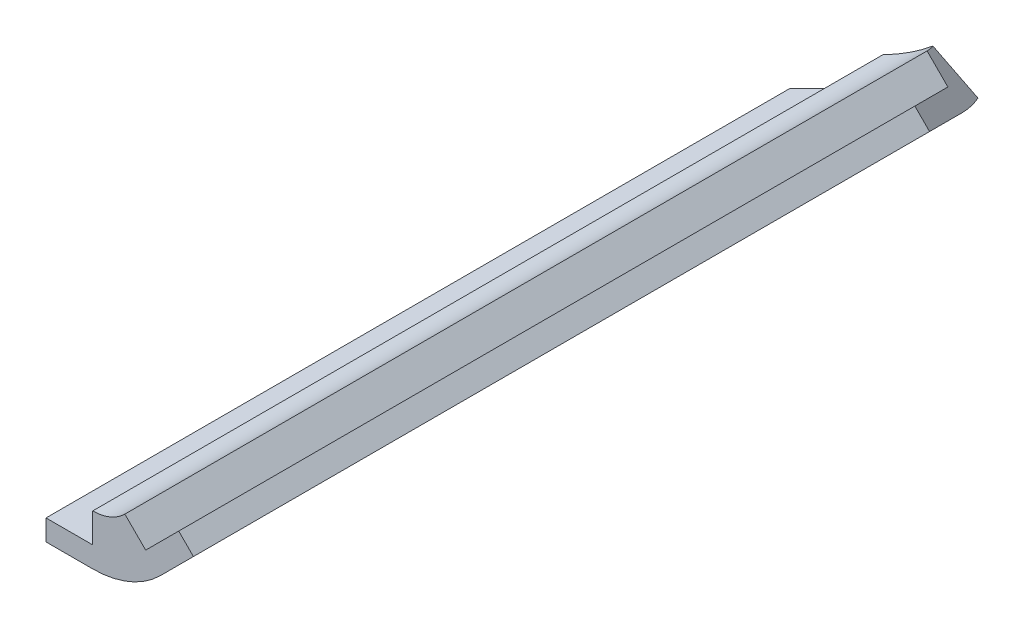
ISO-10303-21;
HEADER;
FILE_DESCRIPTION(('STEP AP214'),'2;1');
FILE_NAME('part.step','',(''),(''),'','','');
FILE_SCHEMA(('AUTOMOTIVE_DESIGN { 1 0 10303 214 1 1 1 1 }'));
ENDSEC;
DATA;
#1=APPLICATION_CONTEXT('core data for automotive mechanical design processes');
#2=APPLICATION_PROTOCOL_DEFINITION('international standard','automotive_design',2000,#1);
#3=PRODUCT_CONTEXT('',#1,'mechanical');
#4=PRODUCT('Part','Part','',(#3));
#5=PRODUCT_RELATED_PRODUCT_CATEGORY('part','',(#4));
#6=PRODUCT_DEFINITION_FORMATION('','',#4);
#7=PRODUCT_DEFINITION_CONTEXT('part definition',#1,'design');
#8=PRODUCT_DEFINITION('design','',#6,#7);
#9=PRODUCT_DEFINITION_SHAPE('','',#8);
#10=(LENGTH_UNIT() NAMED_UNIT(*) SI_UNIT(.MILLI.,.METRE.));
#11=(NAMED_UNIT(*) PLANE_ANGLE_UNIT() SI_UNIT($,.RADIAN.));
#12=(NAMED_UNIT(*) SI_UNIT($,.STERADIAN.) SOLID_ANGLE_UNIT());
#13=UNCERTAINTY_MEASURE_WITH_UNIT(LENGTH_MEASURE(1.E-05),#10,'distance_accuracy_value','');
#14=(GEOMETRIC_REPRESENTATION_CONTEXT(3) GLOBAL_UNCERTAINTY_ASSIGNED_CONTEXT((#13)) GLOBAL_UNIT_ASSIGNED_CONTEXT((#10,
#11,#12)) REPRESENTATION_CONTEXT('',''));
#15=CARTESIAN_POINT('',(0.,0.,0.));
#16=DIRECTION('',(0.,0.,1.));
#17=DIRECTION('',(1.,0.,0.));
#18=AXIS2_PLACEMENT_3D('',#15,#16,#17);
#19=CARTESIAN_POINT('',(-7.3025,-1.500000048,130.175));
#20=DIRECTION('',(1.,0.,0.));
#21=DIRECTION('',(0.,0.,-1.));
#22=AXIS2_PLACEMENT_3D('',#19,#20,#21);
#23=PLANE('',#22);
#24=DIRECTION('',(0.,0.,-1.));
#25=VECTOR('',#24,1.);
#26=CARTESIAN_POINT('',(-7.3025,-1.500000048,130.175));
#27=LINE('',#26,#25);
#28=CARTESIAN_POINT('',(-7.3025,-1.500000048,130.175));
#29=VERTEX_POINT('',#28);
#30=CARTESIAN_POINT('',(-7.3025,-1.500000048,54.4006025755775));
#31=VERTEX_POINT('',#30);
#32=EDGE_CURVE('E223',#29,#31,#27,.T.);
#33=ORIENTED_EDGE('',*,*,#32,.T.);
#34=DIRECTION('',(0.,-1.,0.));
#35=VECTOR('',#34,1.);
#36=CARTESIAN_POINT('',(-7.3025,-1.500000048,54.4006025755775));
#37=LINE('',#36,#35);
#38=CARTESIAN_POINT('',(-7.3025,-3.621225168,54.4006025755775));
#39=VERTEX_POINT('',#38);
#40=EDGE_CURVE('E162',#31,#39,#37,.T.);
#41=ORIENTED_EDGE('',*,*,#40,.T.);
#42=DIRECTION('',(0.,0.,-1.));
#43=VECTOR('',#42,1.);
#44=CARTESIAN_POINT('',(-7.3025,-3.621225168,130.175));
#45=LINE('',#44,#43);
#46=CARTESIAN_POINT('',(-7.3025,-3.621225168,130.175));
#47=VERTEX_POINT('',#46);
#48=EDGE_CURVE('E48',#47,#39,#45,.T.);
#49=ORIENTED_EDGE('',*,*,#48,.F.);
#50=DIRECTION('',(0.,-1.,0.));
#51=VECTOR('',#50,1.);
#52=CARTESIAN_POINT('',(-7.3025,-1.500000048,130.175));
#53=LINE('',#52,#51);
#54=EDGE_CURVE('E217',#29,#47,#53,.T.);
#55=ORIENTED_EDGE('',*,*,#54,.F.);
#56=EDGE_LOOP('',(#33,#41,#49,#55));
#57=FACE_BOUND('',#56,.T.);
#58=ADVANCED_FACE('F40',(#57),#23,.F.);
#59=CARTESIAN_POINT('',(-7.3025,-3.621225168,130.175));
#60=DIRECTION('',(0.,1.,0.));
#61=DIRECTION('',(0.,0.,1.));
#62=AXIS2_PLACEMENT_3D('',#59,#60,#61);
#63=PLANE('',#62);
#64=ORIENTED_EDGE('',*,*,#48,.T.);
#65=DIRECTION('',(0.707106781186548,0.,-0.707106781186547));
#66=VECTOR('',#65,1.);
#67=CARTESIAN_POINT('',(-45.1896987122113,-3.621225168,92.2878012877887));
#68=LINE('',#67,#66);
#69=CARTESIAN_POINT('',(-2.54,-3.621225168,49.6381025755775));
#70=VERTEX_POINT('',#69);
#71=EDGE_CURVE('E156',#39,#70,#68,.T.);
#72=ORIENTED_EDGE('',*,*,#71,.T.);
#73=DIRECTION('',(0.,0.,-1.));
#74=VECTOR('',#73,1.);
#75=CARTESIAN_POINT('',(-2.54,-3.621225168,130.175));
#76=LINE('',#75,#74);
#77=CARTESIAN_POINT('',(-2.54,-3.621225168,130.175));
#78=VERTEX_POINT('',#77);
#79=EDGE_CURVE('E231',#78,#70,#76,.T.);
#80=ORIENTED_EDGE('',*,*,#79,.F.);
#81=DIRECTION('',(1.,0.,0.));
#82=VECTOR('',#81,1.);
#83=CARTESIAN_POINT('',(-7.3025,-3.621225168,130.175));
#84=LINE('',#83,#82);
#85=EDGE_CURVE('E219',#47,#78,#84,.T.);
#86=ORIENTED_EDGE('',*,*,#85,.F.);
#87=EDGE_LOOP('',(#64,#72,#80,#86));
#88=FACE_BOUND('',#87,.T.);
#89=ADVANCED_FACE('F238',(#88),#63,.F.);
#90=CARTESIAN_POINT('',(-7.3025,-1.500000048,130.175));
#91=DIRECTION('',(0.,-1.,0.));
#92=DIRECTION('',(1.,0.,0.));
#93=AXIS2_PLACEMENT_3D('',#90,#91,#92);
#94=PLANE('',#93);
#95=DIRECTION('',(0.,0.,-1.));
#96=VECTOR('',#95,1.);
#97=CARTESIAN_POINT('',(-2.54,-1.500000048,130.175));
#98=LINE('',#97,#96);
#99=CARTESIAN_POINT('',(-2.54,-1.500000048,130.175));
#100=VERTEX_POINT('',#99);
#101=CARTESIAN_POINT('',(-2.54,-1.500000048,49.6381025755775));
#102=VERTEX_POINT('',#101);
#103=EDGE_CURVE('E227',#100,#102,#98,.T.);
#104=ORIENTED_EDGE('',*,*,#103,.T.);
#105=DIRECTION('',(-0.707106781186548,0.,0.707106781186547));
#106=VECTOR('',#105,1.);
#107=CARTESIAN_POINT('',(-45.1896987122113,-1.50000004799999,92.2878012877887));
#108=LINE('',#107,#106);
#109=EDGE_CURVE('E174',#102,#31,#108,.T.);
#110=ORIENTED_EDGE('',*,*,#109,.T.);
#111=ORIENTED_EDGE('',*,*,#32,.F.);
#112=DIRECTION('',(-1.,0.,0.));
#113=VECTOR('',#112,1.);
#114=CARTESIAN_POINT('',(-7.3025,-1.500000048,130.175));
#115=LINE('',#114,#113);
#116=EDGE_CURVE('E62',#100,#29,#115,.T.);
#117=ORIENTED_EDGE('',*,*,#116,.F.);
#118=EDGE_LOOP('',(#104,#110,#111,#117));
#119=FACE_BOUND('',#118,.T.);
#120=ADVANCED_FACE('F243',(#119),#94,.F.);
#121=CARTESIAN_POINT('',(0.,0.,130.175));
#122=DIRECTION('',(0.,0.,1.));
#123=DIRECTION('',(1.,0.,0.));
#124=AXIS2_PLACEMENT_3D('',#121,#122,#123);
#125=PLANE('',#124);
#126=DIRECTION('',(-0.707106781186546,-0.707106781186549,0.));
#127=VECTOR('',#126,1.);
#128=CARTESIAN_POINT('',(6.2243074753357,4.10298706389383,130.175));
#129=LINE('',#128,#127);
#130=CARTESIAN_POINT('',(6.2243074753357,4.10298706389383,130.175));
#131=VERTEX_POINT('',#130);
#132=CARTESIAN_POINT('',(2.85671142993478,0.73539101849289,130.175));
#133=VERTEX_POINT('',#132);
#134=EDGE_CURVE('E191',#131,#133,#129,.T.);
#135=ORIENTED_EDGE('',*,*,#134,.T.);
#136=DIRECTION('',(-0.707106781186549,0.707106781186546,0.));
#137=VECTOR('',#136,1.);
#138=CARTESIAN_POINT('',(2.85671142993478,0.73539101849289,130.175));
#139=LINE('',#138,#137);
#140=CARTESIAN_POINT('',(0.735391018492879,2.85671142993478,130.175));
#141=VERTEX_POINT('',#140);
#142=EDGE_CURVE('E194',#133,#141,#139,.T.);
#143=ORIENTED_EDGE('',*,*,#142,.T.);
#144=CARTESIAN_POINT('',(-2.54,6.13210244842764,130.175));
#145=DIRECTION('',(0.,0.,-1.));
#146=DIRECTION('',(-1.,0.,0.));
#147=AXIS2_PLACEMENT_3D('',#144,#145,#146);
#148=CIRCLE('',#147,4.63210240042764);
#149=CARTESIAN_POINT('',(-2.54,1.500000048,130.175));
#150=VERTEX_POINT('',#149);
#151=EDGE_CURVE('E178',#141,#150,#148,.T.);
#152=ORIENTED_EDGE('',*,*,#151,.T.);
#153=DIRECTION('',(0.,-1.,0.));
#154=VECTOR('',#153,1.);
#155=CARTESIAN_POINT('',(-2.54,1.500000048,130.175));
#156=LINE('',#155,#154);
#157=EDGE_CURVE('E181',#150,#100,#156,.T.);
#158=ORIENTED_EDGE('',*,*,#157,.T.);
#159=ORIENTED_EDGE('',*,*,#116,.T.);
#160=ORIENTED_EDGE('',*,*,#54,.T.);
#161=ORIENTED_EDGE('',*,*,#85,.T.);
#162=CARTESIAN_POINT('',(-2.54,6.13210244842764,130.175));
#163=DIRECTION('',(0.,0.,1.));
#164=DIRECTION('',(-1.,0.,0.));
#165=AXIS2_PLACEMENT_3D('',#162,#163,#164);
#166=CIRCLE('',#165,9.75332761642764);
#167=CARTESIAN_POINT('',(4.35664409671002,-0.764541648282356,130.175));
#168=VERTEX_POINT('',#167);
#169=EDGE_CURVE('E183',#78,#168,#166,.T.);
#170=ORIENTED_EDGE('',*,*,#169,.T.);
#171=DIRECTION('',(0.707106781186546,0.707106781186549,0.));
#172=VECTOR('',#171,1.);
#173=CARTESIAN_POINT('',(7.72424014211095,2.60305439711859,130.175));
#174=LINE('',#173,#172);
#175=CARTESIAN_POINT('',(7.72424014211095,2.60305439711859,130.175));
#176=VERTEX_POINT('',#175);
#177=EDGE_CURVE('E185',#168,#176,#174,.T.);
#178=ORIENTED_EDGE('',*,*,#177,.T.);
#179=DIRECTION('',(-0.707106781186549,0.707106781186546,0.));
#180=VECTOR('',#179,1.);
#181=CARTESIAN_POINT('',(7.72424014211095,2.60305439711859,130.175));
#182=LINE('',#181,#180);
#183=EDGE_CURVE('E188',#176,#131,#182,.T.);
#184=ORIENTED_EDGE('',*,*,#183,.T.);
#185=EDGE_LOOP('',(#135,#143,#152,#158,#159,#160,#161,#170,#178,#184));
#186=FACE_BOUND('',#185,.T.);
#187=ADVANCED_FACE('F247',(#186),#125,.T.);
#188=CARTESIAN_POINT('',(-2.54,6.13210244842764,130.175));
#189=DIRECTION('',(0.,0.,-1.));
#190=DIRECTION('',(-1.,0.,0.));
#191=AXIS2_PLACEMENT_3D('',#188,#189,#190);
#192=CYLINDRICAL_SURFACE('',#191,4.63210240042764);
#193=DIRECTION('',(0.,0.,-1.));
#194=VECTOR('',#193,1.);
#195=CARTESIAN_POINT('',(0.735391018492879,2.85671142993478,130.175));
#196=LINE('',#195,#194);
#197=CARTESIAN_POINT('',(0.735391018492879,2.85671142993478,48.4129033246991));
#198=VERTEX_POINT('',#197);
#199=EDGE_CURVE('E147',#141,#198,#196,.T.);
#200=ORIENTED_EDGE('',*,*,#199,.T.);
#201=CARTESIAN_POINT('',(-2.54,6.13210244842764,48.4129033246991));
#202=DIRECTION('',(-0.577350269189625,-0.577350269189625,0.577350269189628));
#203=DIRECTION('',(-0.408248290463864,-0.408248290463864,-0.816496580927725));
#204=AXIS2_PLACEMENT_3D('',#201,#202,#203);
#205=ELLIPSE('',#204,8.02303670340241,4.63210240042764);
#206=CARTESIAN_POINT('',(0.00707508231867493,2.26315153466861,47.0910274932587));
#207=VERTEX_POINT('',#206);
#208=EDGE_CURVE('E134',#198,#207,#205,.F.);
#209=ORIENTED_EDGE('',*,*,#208,.T.);
#210=CARTESIAN_POINT('',(-2.54,6.13210244842764,49.6381025755775));
#211=DIRECTION('',(0.707106781186547,0.,0.707106781186548));
#212=DIRECTION('',(0.707106781186548,0.,-0.707106781186547));
#213=AXIS2_PLACEMENT_3D('',#210,#211,#212);
#214=ELLIPSE('',#213,6.55078203698574,4.63210240042764);
#215=CARTESIAN_POINT('',(-2.54,1.500000048,49.6381025755775));
#216=VERTEX_POINT('',#215);
#217=EDGE_CURVE('E143',#207,#216,#214,.F.);
#218=ORIENTED_EDGE('',*,*,#217,.T.);
#219=DIRECTION('',(0.,0.,-1.));
#220=VECTOR('',#219,1.);
#221=CARTESIAN_POINT('',(-2.54,1.500000048,130.175));
#222=LINE('',#221,#220);
#223=EDGE_CURVE('E214',#150,#216,#222,.T.);
#224=ORIENTED_EDGE('',*,*,#223,.F.);
#225=ORIENTED_EDGE('',*,*,#151,.F.);
#226=EDGE_LOOP('',(#200,#209,#218,#224,#225));
#227=FACE_BOUND('',#226,.T.);
#228=ADVANCED_FACE('F141',(#227),#192,.F.);
#229=CARTESIAN_POINT('',(-2.54,1.500000048,130.175));
#230=DIRECTION('',(1.,0.,0.));
#231=DIRECTION('',(0.,0.,-1.));
#232=AXIS2_PLACEMENT_3D('',#229,#230,#231);
#233=PLANE('',#232);
#234=ORIENTED_EDGE('',*,*,#223,.T.);
#235=DIRECTION('',(0.,-1.,0.));
#236=VECTOR('',#235,1.);
#237=CARTESIAN_POINT('',(-2.54,1.500000048,49.6381025755775));
#238=LINE('',#237,#236);
#239=EDGE_CURVE('E153',#216,#102,#238,.T.);
#240=ORIENTED_EDGE('',*,*,#239,.T.);
#241=ORIENTED_EDGE('',*,*,#103,.F.);
#242=ORIENTED_EDGE('',*,*,#157,.F.);
#243=EDGE_LOOP('',(#234,#240,#241,#242));
#244=FACE_BOUND('',#243,.T.);
#245=ADVANCED_FACE('F246',(#244),#233,.F.);
#246=CARTESIAN_POINT('',(-2.54,6.13210244842764,130.175));
#247=DIRECTION('',(0.,0.,-1.));
#248=DIRECTION('',(-1.,0.,0.));
#249=AXIS2_PLACEMENT_3D('',#246,#247,#248);
#250=CYLINDRICAL_SURFACE('',#249,9.75332761642764);
#251=CARTESIAN_POINT('',(-2.54,6.13210244842764,49.6381025755775));
#252=DIRECTION('',(0.707106781186547,0.,0.707106781186548));
#253=DIRECTION('',(0.707106781186548,0.,-0.707106781186547));
#254=AXIS2_PLACEMENT_3D('',#251,#252,#253);
#255=ELLIPSE('',#254,13.79328819342,9.75332761642764);
#256=CARTESIAN_POINT('',(2.30501200642674,-2.33272231354753,44.7930905691506));
#257=VERTEX_POINT('',#256);
#258=EDGE_CURVE('E157',#70,#257,#255,.T.);
#259=ORIENTED_EDGE('',*,*,#258,.T.);
#260=CARTESIAN_POINT('',(-2.54,6.13210244842764,48.4129033246991));
#261=DIRECTION('',(-0.577350269189625,-0.577350269189625,0.577350269189628));
#262=DIRECTION('',(-0.408248290463864,-0.408248290463864,-0.816496580927725));
#263=AXIS2_PLACEMENT_3D('',#260,#261,#262);
#264=ELLIPSE('',#263,16.8932589745173,9.75332761642764);
#265=CARTESIAN_POINT('',(4.35664409671002,-0.764541648282356,48.4129033246991));
#266=VERTEX_POINT('',#265);
#267=EDGE_CURVE('E55',#257,#266,#264,.T.);
#268=ORIENTED_EDGE('',*,*,#267,.T.);
#269=DIRECTION('',(0.,0.,-1.));
#270=VECTOR('',#269,1.);
#271=CARTESIAN_POINT('',(4.35664409671002,-0.764541648282356,130.175));
#272=LINE('',#271,#270);
#273=EDGE_CURVE('E210',#168,#266,#272,.T.);
#274=ORIENTED_EDGE('',*,*,#273,.F.);
#275=ORIENTED_EDGE('',*,*,#169,.F.);
#276=ORIENTED_EDGE('',*,*,#79,.T.);
#277=EDGE_LOOP('',(#259,#268,#274,#275,#276));
#278=FACE_BOUND('',#277,.T.);
#279=ADVANCED_FACE('F275',(#278),#250,.T.);
#280=CARTESIAN_POINT('',(7.72424014211095,2.60305439711859,130.175));
#281=DIRECTION('',(-0.707106781186549,0.707106781186546,0.));
#282=DIRECTION('',(-0.707106781186546,-0.707106781186549,0.));
#283=AXIS2_PLACEMENT_3D('',#280,#281,#282);
#284=PLANE('',#283);
#285=ORIENTED_EDGE('',*,*,#273,.T.);
#286=DIRECTION('',(0.408248290463864,0.408248290463865,0.816496580927725));
#287=VECTOR('',#286,1.);
#288=CARTESIAN_POINT('',(32.7332083369439,27.6120225919517,105.166031805167));
#289=LINE('',#288,#287);
#290=CARTESIAN_POINT('',(7.72424014211095,2.60305439711859,55.1480954155009));
#291=VERTEX_POINT('',#290);
#292=EDGE_CURVE('E165',#266,#291,#289,.T.);
#293=ORIENTED_EDGE('',*,*,#292,.T.);
#294=DIRECTION('',(0.,0.,-1.));
#295=VECTOR('',#294,1.);
#296=CARTESIAN_POINT('',(7.72424014211095,2.60305439711859,130.175));
#297=LINE('',#296,#295);
#298=EDGE_CURVE('E206',#176,#291,#297,.T.);
#299=ORIENTED_EDGE('',*,*,#298,.F.);
#300=ORIENTED_EDGE('',*,*,#177,.F.);
#301=EDGE_LOOP('',(#285,#293,#299,#300));
#302=FACE_BOUND('',#301,.T.);
#303=ADVANCED_FACE('F267',(#302),#284,.F.);
#304=CARTESIAN_POINT('',(7.72424014211095,2.60305439711859,130.175));
#305=DIRECTION('',(-0.707106781186546,-0.707106781186549,0.));
#306=DIRECTION('',(0.707106781186549,-0.707106781186546,0.));
#307=AXIS2_PLACEMENT_3D('',#304,#305,#306);
#308=PLANE('',#307);
#309=ORIENTED_EDGE('',*,*,#298,.T.);
#310=DIRECTION('',(-0.707106781186549,0.707106781186546,0.));
#311=VECTOR('',#310,1.);
#312=CARTESIAN_POINT('',(7.72424014211111,2.60305439711843,55.1480954155009));
#313=LINE('',#312,#311);
#314=CARTESIAN_POINT('',(6.2243074753357,4.10298706389382,55.1480954155009));
#315=VERTEX_POINT('',#314);
#316=EDGE_CURVE('E257',#291,#315,#313,.T.);
#317=ORIENTED_EDGE('',*,*,#316,.T.);
#318=DIRECTION('',(0.,0.,-1.));
#319=VECTOR('',#318,1.);
#320=CARTESIAN_POINT('',(6.2243074753357,4.10298706389383,130.175));
#321=LINE('',#320,#319);
#322=EDGE_CURVE('E202',#131,#315,#321,.T.);
#323=ORIENTED_EDGE('',*,*,#322,.F.);
#324=ORIENTED_EDGE('',*,*,#183,.F.);
#325=EDGE_LOOP('',(#309,#317,#323,#324));
#326=FACE_BOUND('',#325,.T.);
#327=ADVANCED_FACE('F272',(#326),#308,.F.);
#328=CARTESIAN_POINT('',(6.2243074753357,4.10298706389383,130.175));
#329=DIRECTION('',(0.707106781186549,-0.707106781186546,0.));
#330=DIRECTION('',(0.707106781186546,0.707106781186549,0.));
#331=AXIS2_PLACEMENT_3D('',#328,#329,#330);
#332=PLANE('',#331);
#333=ORIENTED_EDGE('',*,*,#322,.T.);
#334=DIRECTION('',(-0.408248290463863,-0.408248290463865,-0.816496580927725));
#335=VECTOR('',#334,1.);
#336=CARTESIAN_POINT('',(31.2332756701687,29.1119552587269,105.166031805167));
#337=LINE('',#336,#335);
#338=CARTESIAN_POINT('',(2.85671142993478,0.73539101849289,48.4129033246991));
#339=VERTEX_POINT('',#338);
#340=EDGE_CURVE('E254',#315,#339,#337,.T.);
#341=ORIENTED_EDGE('',*,*,#340,.T.);
#342=DIRECTION('',(0.,0.,-1.));
#343=VECTOR('',#342,1.);
#344=CARTESIAN_POINT('',(2.85671142993478,0.73539101849289,130.175));
#345=LINE('',#344,#343);
#346=EDGE_CURVE('E198',#133,#339,#345,.T.);
#347=ORIENTED_EDGE('',*,*,#346,.F.);
#348=ORIENTED_EDGE('',*,*,#134,.F.);
#349=EDGE_LOOP('',(#333,#341,#347,#348));
#350=FACE_BOUND('',#349,.T.);
#351=ADVANCED_FACE('F348',(#350),#332,.F.);
#352=CARTESIAN_POINT('',(2.85671142993478,0.73539101849289,130.175));
#353=DIRECTION('',(-0.707106781186546,-0.707106781186549,0.));
#354=DIRECTION('',(0.707106781186549,-0.707106781186546,0.));
#355=AXIS2_PLACEMENT_3D('',#352,#353,#354);
#356=PLANE('',#355);
#357=ORIENTED_EDGE('',*,*,#346,.T.);
#358=DIRECTION('',(-0.707106781186549,0.707106781186546,0.));
#359=VECTOR('',#358,1.);
#360=CARTESIAN_POINT('',(2.85671142993495,0.735391018492717,48.4129033246991));
#361=LINE('',#360,#359);
#362=EDGE_CURVE('E149',#339,#198,#361,.T.);
#363=ORIENTED_EDGE('',*,*,#362,.T.);
#364=ORIENTED_EDGE('',*,*,#199,.F.);
#365=ORIENTED_EDGE('',*,*,#142,.F.);
#366=EDGE_LOOP('',(#357,#363,#364,#365));
#367=FACE_BOUND('',#366,.T.);
#368=ADVANCED_FACE('F252',(#367),#356,.F.);
#369=CARTESIAN_POINT('',(945.123714682493,4.10298706389384,-898.025612106915));
#370=DIRECTION('',(0.707106781186547,0.,0.707106781186548));
#371=DIRECTION('',(0.707106781186548,0.,-0.707106781186547));
#372=AXIS2_PLACEMENT_3D('',#369,#370,#371);
#373=PLANE('',#372);
#374=ORIENTED_EDGE('',*,*,#217,.F.);
#375=DIRECTION('',(0.408248290463863,-0.816496580927727,-0.408248290463862));
#376=VECTOR('',#375,1.);
#377=CARTESIAN_POINT('',(314.432676439301,-626.588051179297,-267.334573863723));
#378=LINE('',#377,#376);
#379=EDGE_CURVE('E11',#207,#257,#378,.T.);
#380=ORIENTED_EDGE('',*,*,#379,.T.);
#381=ORIENTED_EDGE('',*,*,#258,.F.);
#382=ORIENTED_EDGE('',*,*,#71,.F.);
#383=ORIENTED_EDGE('',*,*,#40,.F.);
#384=ORIENTED_EDGE('',*,*,#109,.F.);
#385=ORIENTED_EDGE('',*,*,#239,.F.);
#386=EDGE_LOOP('',(#374,#380,#381,#382,#383,#384,#385));
#387=FACE_BOUND('',#386,.T.);
#388=ADVANCED_FACE('F151',(#387),#373,.F.);
#389=CARTESIAN_POINT('',(-14.9402669587572,-14.9402669587572,14.9402669587572));
#390=DIRECTION('',(-0.577350269189625,-0.577350269189625,0.577350269189628));
#391=DIRECTION('',(0.,-0.707106781186549,-0.707106781186546));
#392=AXIS2_PLACEMENT_3D('',#389,#390,#391);
#393=PLANE('',#392);
#394=ORIENTED_EDGE('',*,*,#267,.F.);
#395=ORIENTED_EDGE('',*,*,#379,.F.);
#396=ORIENTED_EDGE('',*,*,#208,.F.);
#397=ORIENTED_EDGE('',*,*,#362,.F.);
#398=ORIENTED_EDGE('',*,*,#340,.F.);
#399=ORIENTED_EDGE('',*,*,#316,.F.);
#400=ORIENTED_EDGE('',*,*,#292,.F.);
#401=EDGE_LOOP('',(#394,#395,#396,#397,#398,#399,#400));
#402=FACE_BOUND('',#401,.T.);
#403=ADVANCED_FACE('F133',(#402),#393,.F.);
#404=CLOSED_SHELL('',(#58,#89,#120,#187,#228,#245,#279,#303,#327,#351,#368,#388,#403));
#405=MANIFOLD_SOLID_BREP('B2',#404);
#406=ADVANCED_BREP_SHAPE_REPRESENTATION('',(#18,#405),#14);
#407=SHAPE_DEFINITION_REPRESENTATION(#9,#406);
ENDSEC;
END-ISO-10303-21;
